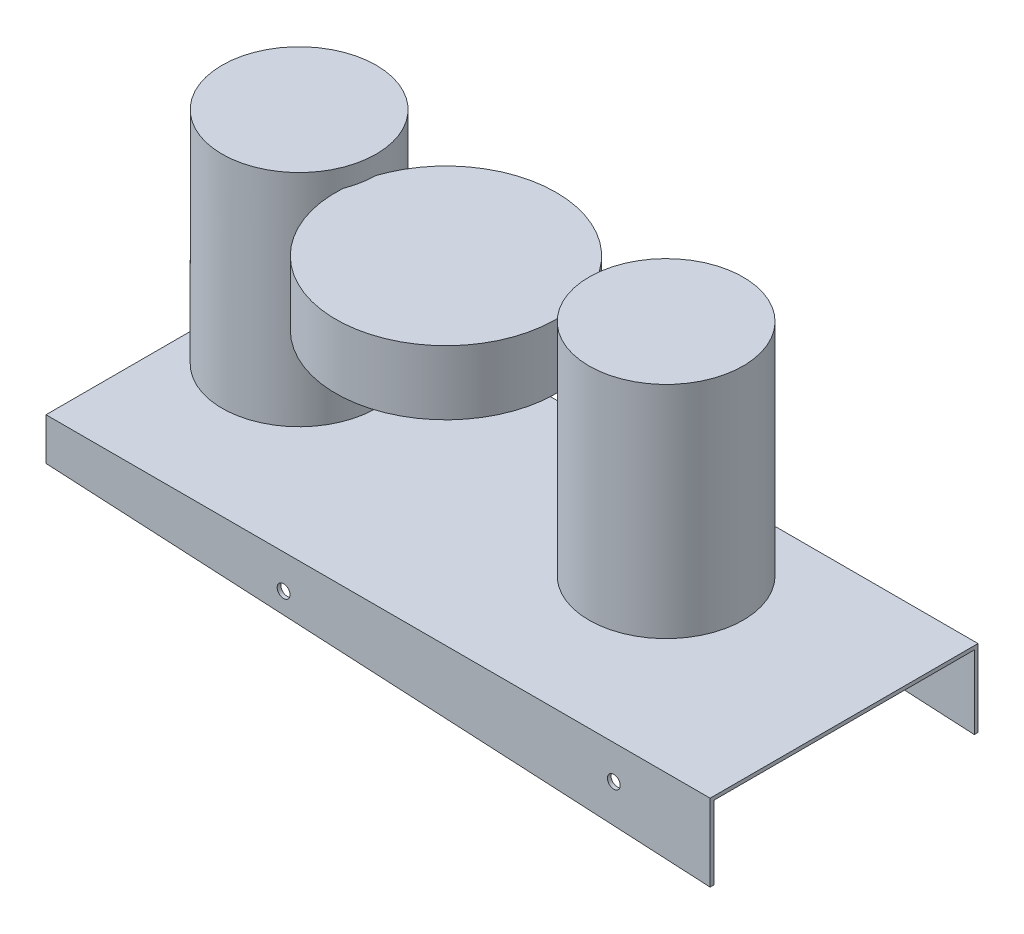
ISO-10303-21;
HEADER;
FILE_DESCRIPTION(('STEP AP214'),'2;1');
FILE_NAME('part.step','',(''),(''),'','','');
FILE_SCHEMA(('AUTOMOTIVE_DESIGN { 1 0 10303 214 1 1 1 1 }'));
ENDSEC;
DATA;
#1=APPLICATION_CONTEXT('core data for automotive mechanical design processes');
#2=APPLICATION_PROTOCOL_DEFINITION('international standard','automotive_design',2000,#1);
#3=PRODUCT_CONTEXT('',#1,'mechanical');
#4=PRODUCT('Part','Part','',(#3));
#5=PRODUCT_RELATED_PRODUCT_CATEGORY('part','',(#4));
#6=PRODUCT_DEFINITION_FORMATION('','',#4);
#7=PRODUCT_DEFINITION_CONTEXT('part definition',#1,'design');
#8=PRODUCT_DEFINITION('design','',#6,#7);
#9=PRODUCT_DEFINITION_SHAPE('','',#8);
#10=(LENGTH_UNIT() NAMED_UNIT(*) SI_UNIT(.MILLI.,.METRE.));
#11=(NAMED_UNIT(*) PLANE_ANGLE_UNIT() SI_UNIT($,.RADIAN.));
#12=(NAMED_UNIT(*) SI_UNIT($,.STERADIAN.) SOLID_ANGLE_UNIT());
#13=UNCERTAINTY_MEASURE_WITH_UNIT(LENGTH_MEASURE(1.E-05),#10,'distance_accuracy_value','');
#14=(GEOMETRIC_REPRESENTATION_CONTEXT(3) GLOBAL_UNCERTAINTY_ASSIGNED_CONTEXT((#13)) GLOBAL_UNIT_ASSIGNED_CONTEXT((#10,
#11,#12)) REPRESENTATION_CONTEXT('',''));
#15=CARTESIAN_POINT('',(0.,0.,0.));
#16=DIRECTION('',(0.,0.,1.));
#17=DIRECTION('',(1.,0.,0.));
#18=AXIS2_PLACEMENT_3D('',#15,#16,#17);
#19=CARTESIAN_POINT('',(-181.,-2.,73.));
#20=DIRECTION('',(0.,0.,1.));
#21=DIRECTION('',(1.,0.,0.));
#22=AXIS2_PLACEMENT_3D('',#19,#20,#21);
#23=PLANE('',#22);
#24=CARTESIAN_POINT('',(128.5,-18.5,73.));
#25=DIRECTION('',(0.,0.,1.));
#26=DIRECTION('',(1.,0.,0.));
#27=AXIS2_PLACEMENT_3D('',#24,#25,#26);
#28=CIRCLE('',#27,3.49999999999999);
#29=CARTESIAN_POINT('',(132.,-18.5,73.));
#30=VERTEX_POINT('',#29);
#31=EDGE_CURVE('E144',#30,#30,#28,.T.);
#32=ORIENTED_EDGE('',*,*,#31,.F.);
#33=EDGE_LOOP('',(#32));
#34=FACE_BOUND('',#33,.T.);
#35=CARTESIAN_POINT('',(-51.5,-18.5,73.));
#36=DIRECTION('',(0.,0.,1.));
#37=DIRECTION('',(1.,0.,0.));
#38=AXIS2_PLACEMENT_3D('',#35,#36,#37);
#39=CIRCLE('',#38,3.5);
#40=CARTESIAN_POINT('',(-48.,-18.5,73.));
#41=VERTEX_POINT('',#40);
#42=EDGE_CURVE('E148',#41,#41,#39,.T.);
#43=ORIENTED_EDGE('',*,*,#42,.F.);
#44=EDGE_LOOP('',(#43));
#45=FACE_BOUND('',#44,.T.);
#46=DIRECTION('',(0.,1.,0.));
#47=VECTOR('',#46,1.);
#48=CARTESIAN_POINT('',(-181.,-2.,73.));
#49=LINE('',#48,#47);
#50=CARTESIAN_POINT('',(-181.,-23.,73.));
#51=VERTEX_POINT('',#50);
#52=CARTESIAN_POINT('',(-181.,0.,73.));
#53=VERTEX_POINT('',#52);
#54=EDGE_CURVE('E217',#51,#53,#49,.T.);
#55=ORIENTED_EDGE('',*,*,#54,.F.);
#56=DIRECTION('',(0.998625439371292,-0.0524140423979408,0.));
#57=VECTOR('',#56,1.);
#58=CARTESIAN_POINT('',(-1.70111487386325,-32.410714965184,73.));
#59=LINE('',#58,#57);
#60=CARTESIAN_POINT('',(181.,-42.,73.));
#61=VERTEX_POINT('',#60);
#62=EDGE_CURVE('E163',#51,#61,#59,.T.);
#63=ORIENTED_EDGE('',*,*,#62,.T.);
#64=DIRECTION('',(0.,1.,0.));
#65=VECTOR('',#64,1.);
#66=CARTESIAN_POINT('',(181.,-2.,73.));
#67=LINE('',#66,#65);
#68=CARTESIAN_POINT('',(181.,0.,73.));
#69=VERTEX_POINT('',#68);
#70=EDGE_CURVE('E143',#61,#69,#67,.T.);
#71=ORIENTED_EDGE('',*,*,#70,.T.);
#72=DIRECTION('',(1.,0.,0.));
#73=VECTOR('',#72,1.);
#74=CARTESIAN_POINT('',(-181.,0.,73.));
#75=LINE('',#74,#73);
#76=EDGE_CURVE('E203',#53,#69,#75,.T.);
#77=ORIENTED_EDGE('',*,*,#76,.F.);
#78=EDGE_LOOP('',(#55,#63,#71,#77));
#79=FACE_BOUND('',#78,.T.);
#80=ADVANCED_FACE('F42',(#34,#45,#79),#23,.T.);
#81=CARTESIAN_POINT('',(-181.,-2.,73.));
#82=DIRECTION('',(-1.,0.,0.));
#83=DIRECTION('',(0.,0.,1.));
#84=AXIS2_PLACEMENT_3D('',#81,#82,#83);
#85=PLANE('',#84);
#86=DIRECTION('',(0.,1.,0.));
#87=VECTOR('',#86,1.);
#88=CARTESIAN_POINT('',(-181.,-2.,-73.));
#89=LINE('',#88,#87);
#90=CARTESIAN_POINT('',(-181.,-23.,-73.));
#91=VERTEX_POINT('',#90);
#92=CARTESIAN_POINT('',(-181.,0.,-73.));
#93=VERTEX_POINT('',#92);
#94=EDGE_CURVE('E219',#91,#93,#89,.T.);
#95=ORIENTED_EDGE('',*,*,#94,.F.);
#96=DIRECTION('',(0.,0.,1.));
#97=VECTOR('',#96,1.);
#98=CARTESIAN_POINT('',(-181.,-23.,-73.));
#99=LINE('',#98,#97);
#100=CARTESIAN_POINT('',(-181.,-23.,-71.));
#101=VERTEX_POINT('',#100);
#102=EDGE_CURVE('E169',#91,#101,#99,.T.);
#103=ORIENTED_EDGE('',*,*,#102,.T.);
#104=DIRECTION('',(0.,1.,0.));
#105=VECTOR('',#104,1.);
#106=CARTESIAN_POINT('',(-181.,-42.,-71.));
#107=LINE('',#106,#105);
#108=CARTESIAN_POINT('',(-181.,-2.00000000000002,-71.));
#109=VERTEX_POINT('',#108);
#110=EDGE_CURVE('E191',#101,#109,#107,.T.);
#111=ORIENTED_EDGE('',*,*,#110,.T.);
#112=DIRECTION('',(0.,0.,1.));
#113=VECTOR('',#112,1.);
#114=CARTESIAN_POINT('',(-181.,-2.,73.));
#115=LINE('',#114,#113);
#116=CARTESIAN_POINT('',(-181.,-2.00000000000002,71.));
#117=VERTEX_POINT('',#116);
#118=EDGE_CURVE('E202',#109,#117,#115,.T.);
#119=ORIENTED_EDGE('',*,*,#118,.T.);
#120=DIRECTION('',(0.,1.,0.));
#121=VECTOR('',#120,1.);
#122=CARTESIAN_POINT('',(-181.,-42.,71.));
#123=LINE('',#122,#121);
#124=CARTESIAN_POINT('',(-181.,-23.,71.));
#125=VERTEX_POINT('',#124);
#126=EDGE_CURVE('E178',#125,#117,#123,.T.);
#127=ORIENTED_EDGE('',*,*,#126,.F.);
#128=EDGE_CURVE('E168',#125,#51,#99,.T.);
#129=ORIENTED_EDGE('',*,*,#128,.T.);
#130=ORIENTED_EDGE('',*,*,#54,.T.);
#131=DIRECTION('',(0.,0.,1.));
#132=VECTOR('',#131,1.);
#133=CARTESIAN_POINT('',(-181.,0.,73.));
#134=LINE('',#133,#132);
#135=EDGE_CURVE('E211',#93,#53,#134,.T.);
#136=ORIENTED_EDGE('',*,*,#135,.F.);
#137=EDGE_LOOP('',(#95,#103,#111,#119,#127,#129,#130,#136));
#138=FACE_BOUND('',#137,.T.);
#139=ADVANCED_FACE('F254',(#138),#85,.T.);
#140=CARTESIAN_POINT('',(-181.,-2.,-73.));
#141=DIRECTION('',(0.,0.,-1.));
#142=DIRECTION('',(-1.,0.,0.));
#143=AXIS2_PLACEMENT_3D('',#140,#141,#142);
#144=PLANE('',#143);
#145=CARTESIAN_POINT('',(128.5,-18.5,-73.));
#146=DIRECTION('',(0.,0.,1.));
#147=DIRECTION('',(1.,0.,0.));
#148=AXIS2_PLACEMENT_3D('',#145,#146,#147);
#149=CIRCLE('',#148,3.49999999999999);
#150=CARTESIAN_POINT('',(132.,-18.5,-73.));
#151=VERTEX_POINT('',#150);
#152=EDGE_CURVE('E147',#151,#151,#149,.T.);
#153=ORIENTED_EDGE('',*,*,#152,.T.);
#154=EDGE_LOOP('',(#153));
#155=FACE_BOUND('',#154,.T.);
#156=CARTESIAN_POINT('',(-51.5,-18.5,-73.));
#157=DIRECTION('',(0.,0.,1.));
#158=DIRECTION('',(1.,0.,0.));
#159=AXIS2_PLACEMENT_3D('',#156,#157,#158);
#160=CIRCLE('',#159,3.5);
#161=CARTESIAN_POINT('',(-48.,-18.5,-73.));
#162=VERTEX_POINT('',#161);
#163=EDGE_CURVE('E139',#162,#162,#160,.T.);
#164=ORIENTED_EDGE('',*,*,#163,.T.);
#165=EDGE_LOOP('',(#164));
#166=FACE_BOUND('',#165,.T.);
#167=DIRECTION('',(0.,1.,0.));
#168=VECTOR('',#167,1.);
#169=CARTESIAN_POINT('',(181.,-2.,-73.));
#170=LINE('',#169,#168);
#171=CARTESIAN_POINT('',(181.,-42.,-73.));
#172=VERTEX_POINT('',#171);
#173=CARTESIAN_POINT('',(181.,0.,-73.));
#174=VERTEX_POINT('',#173);
#175=EDGE_CURVE('E206',#172,#174,#170,.T.);
#176=ORIENTED_EDGE('',*,*,#175,.F.);
#177=DIRECTION('',(0.998625439371292,-0.0524140423979408,0.));
#178=VECTOR('',#177,1.);
#179=CARTESIAN_POINT('',(-1.70111487386325,-32.410714965184,-73.));
#180=LINE('',#179,#178);
#181=EDGE_CURVE('E166',#91,#172,#180,.T.);
#182=ORIENTED_EDGE('',*,*,#181,.F.);
#183=ORIENTED_EDGE('',*,*,#94,.T.);
#184=DIRECTION('',(-1.,0.,0.));
#185=VECTOR('',#184,1.);
#186=CARTESIAN_POINT('',(-181.,0.,-73.));
#187=LINE('',#186,#185);
#188=EDGE_CURVE('E208',#174,#93,#187,.T.);
#189=ORIENTED_EDGE('',*,*,#188,.F.);
#190=EDGE_LOOP('',(#176,#182,#183,#189));
#191=FACE_BOUND('',#190,.T.);
#192=ADVANCED_FACE('F253',(#155,#166,#191),#144,.T.);
#193=CARTESIAN_POINT('',(-181.,-42.,-71.));
#194=DIRECTION('',(0.,0.,1.));
#195=DIRECTION('',(1.,0.,0.));
#196=AXIS2_PLACEMENT_3D('',#193,#194,#195);
#197=PLANE('',#196);
#198=CARTESIAN_POINT('',(128.5,-18.5,-71.));
#199=DIRECTION('',(0.,0.,1.));
#200=DIRECTION('',(1.,0.,0.));
#201=AXIS2_PLACEMENT_3D('',#198,#199,#200);
#202=CIRCLE('',#201,3.49999999999999);
#203=CARTESIAN_POINT('',(132.,-18.5,-71.));
#204=VERTEX_POINT('',#203);
#205=EDGE_CURVE('E160',#204,#204,#202,.T.);
#206=ORIENTED_EDGE('',*,*,#205,.F.);
#207=EDGE_LOOP('',(#206));
#208=FACE_BOUND('',#207,.T.);
#209=CARTESIAN_POINT('',(-51.5,-18.5,-71.));
#210=DIRECTION('',(0.,0.,1.));
#211=DIRECTION('',(1.,0.,0.));
#212=AXIS2_PLACEMENT_3D('',#209,#210,#211);
#213=CIRCLE('',#212,3.5);
#214=CARTESIAN_POINT('',(-48.,-18.5,-71.));
#215=VERTEX_POINT('',#214);
#216=EDGE_CURVE('E156',#215,#215,#213,.T.);
#217=ORIENTED_EDGE('',*,*,#216,.F.);
#218=EDGE_LOOP('',(#217));
#219=FACE_BOUND('',#218,.T.);
#220=ORIENTED_EDGE('',*,*,#110,.F.);
#221=DIRECTION('',(0.998625439371293,-0.0524140423979408,0.));
#222=VECTOR('',#221,1.);
#223=CARTESIAN_POINT('',(-180.005502073741,-23.0521974049694,-71.));
#224=LINE('',#223,#222);
#225=CARTESIAN_POINT('',(181.,-42.,-71.));
#226=VERTEX_POINT('',#225);
#227=EDGE_CURVE('E175',#101,#226,#224,.T.);
#228=ORIENTED_EDGE('',*,*,#227,.T.);
#229=DIRECTION('',(0.,1.,0.));
#230=VECTOR('',#229,1.);
#231=CARTESIAN_POINT('',(181.,-42.,-71.));
#232=LINE('',#231,#230);
#233=CARTESIAN_POINT('',(181.,-2.,-71.));
#234=VERTEX_POINT('',#233);
#235=EDGE_CURVE('E192',#226,#234,#232,.T.);
#236=ORIENTED_EDGE('',*,*,#235,.T.);
#237=DIRECTION('',(-1.,0.,0.));
#238=VECTOR('',#237,1.);
#239=CARTESIAN_POINT('',(0.,-2.,-71.));
#240=LINE('',#239,#238);
#241=EDGE_CURVE('E195',#234,#109,#240,.T.);
#242=ORIENTED_EDGE('',*,*,#241,.T.);
#243=EDGE_LOOP('',(#220,#228,#236,#242));
#244=FACE_BOUND('',#243,.T.);
#245=ADVANCED_FACE('F259',(#208,#219,#244),#197,.T.);
#246=CARTESIAN_POINT('',(-181.,-42.,71.));
#247=DIRECTION('',(0.,0.,-1.));
#248=DIRECTION('',(-1.,0.,0.));
#249=AXIS2_PLACEMENT_3D('',#246,#247,#248);
#250=PLANE('',#249);
#251=CARTESIAN_POINT('',(128.5,-18.5,71.));
#252=DIRECTION('',(0.,0.,-1.));
#253=DIRECTION('',(-1.,0.,0.));
#254=AXIS2_PLACEMENT_3D('',#251,#252,#253);
#255=CIRCLE('',#254,3.49999999999999);
#256=CARTESIAN_POINT('',(125.,-18.5,71.));
#257=VERTEX_POINT('',#256);
#258=EDGE_CURVE('E159',#257,#257,#255,.T.);
#259=ORIENTED_EDGE('',*,*,#258,.F.);
#260=EDGE_LOOP('',(#259));
#261=FACE_BOUND('',#260,.T.);
#262=CARTESIAN_POINT('',(-51.5,-18.5,71.));
#263=DIRECTION('',(0.,0.,-1.));
#264=DIRECTION('',(-1.,0.,0.));
#265=AXIS2_PLACEMENT_3D('',#262,#263,#264);
#266=CIRCLE('',#265,3.5);
#267=CARTESIAN_POINT('',(-55.,-18.5,71.));
#268=VERTEX_POINT('',#267);
#269=EDGE_CURVE('E151',#268,#268,#266,.T.);
#270=ORIENTED_EDGE('',*,*,#269,.F.);
#271=EDGE_LOOP('',(#270));
#272=FACE_BOUND('',#271,.T.);
#273=DIRECTION('',(0.,1.,0.));
#274=VECTOR('',#273,1.);
#275=CARTESIAN_POINT('',(181.,-42.,71.));
#276=LINE('',#275,#274);
#277=CARTESIAN_POINT('',(181.,-42.,71.));
#278=VERTEX_POINT('',#277);
#279=CARTESIAN_POINT('',(181.,-2.00000000000002,71.));
#280=VERTEX_POINT('',#279);
#281=EDGE_CURVE('E179',#278,#280,#276,.T.);
#282=ORIENTED_EDGE('',*,*,#281,.F.);
#283=DIRECTION('',(-0.998625439371293,0.0524140423979408,0.));
#284=VECTOR('',#283,1.);
#285=CARTESIAN_POINT('',(-180.005502073741,-23.0521974049694,71.));
#286=LINE('',#285,#284);
#287=EDGE_CURVE('E172',#278,#125,#286,.T.);
#288=ORIENTED_EDGE('',*,*,#287,.T.);
#289=ORIENTED_EDGE('',*,*,#126,.T.);
#290=DIRECTION('',(1.,0.,0.));
#291=VECTOR('',#290,1.);
#292=CARTESIAN_POINT('',(0.,-2.,71.));
#293=LINE('',#292,#291);
#294=EDGE_CURVE('E186',#117,#280,#293,.T.);
#295=ORIENTED_EDGE('',*,*,#294,.T.);
#296=EDGE_LOOP('',(#282,#288,#289,#295));
#297=FACE_BOUND('',#296,.T.);
#298=ADVANCED_FACE('F268',(#261,#272,#297),#250,.T.);
#299=CARTESIAN_POINT('',(181.,-2.,73.));
#300=DIRECTION('',(1.,0.,0.));
#301=DIRECTION('',(0.,0.,-1.));
#302=AXIS2_PLACEMENT_3D('',#299,#300,#301);
#303=PLANE('',#302);
#304=ORIENTED_EDGE('',*,*,#175,.T.);
#305=DIRECTION('',(0.,0.,-1.));
#306=VECTOR('',#305,1.);
#307=CARTESIAN_POINT('',(181.,0.,73.));
#308=LINE('',#307,#306);
#309=EDGE_CURVE('E199',#69,#174,#308,.T.);
#310=ORIENTED_EDGE('',*,*,#309,.F.);
#311=ORIENTED_EDGE('',*,*,#70,.F.);
#312=DIRECTION('',(0.,0.,-1.));
#313=VECTOR('',#312,1.);
#314=CARTESIAN_POINT('',(181.,-42.,73.));
#315=LINE('',#314,#313);
#316=EDGE_CURVE('E182',#61,#278,#315,.T.);
#317=ORIENTED_EDGE('',*,*,#316,.T.);
#318=ORIENTED_EDGE('',*,*,#281,.T.);
#319=DIRECTION('',(0.,0.,-1.));
#320=VECTOR('',#319,1.);
#321=CARTESIAN_POINT('',(181.,-2.,73.));
#322=LINE('',#321,#320);
#323=EDGE_CURVE('E200',#280,#234,#322,.T.);
#324=ORIENTED_EDGE('',*,*,#323,.T.);
#325=ORIENTED_EDGE('',*,*,#235,.F.);
#326=DIRECTION('',(0.,0.,-1.));
#327=VECTOR('',#326,1.);
#328=CARTESIAN_POINT('',(181.,-42.,-73.));
#329=LINE('',#328,#327);
#330=EDGE_CURVE('E188',#226,#172,#329,.T.);
#331=ORIENTED_EDGE('',*,*,#330,.T.);
#332=EDGE_LOOP('',(#304,#310,#311,#317,#318,#324,#325,#331));
#333=FACE_BOUND('',#332,.T.);
#334=ADVANCED_FACE('F44',(#333),#303,.T.);
#335=CARTESIAN_POINT('',(0.,-2.,0.));
#336=DIRECTION('',(0.,-1.,0.));
#337=DIRECTION('',(0.,0.,-1.));
#338=AXIS2_PLACEMENT_3D('',#335,#336,#337);
#339=PLANE('',#338);
#340=ORIENTED_EDGE('',*,*,#294,.F.);
#341=ORIENTED_EDGE('',*,*,#118,.F.);
#342=ORIENTED_EDGE('',*,*,#241,.F.);
#343=ORIENTED_EDGE('',*,*,#323,.F.);
#344=EDGE_LOOP('',(#340,#341,#342,#343));
#345=FACE_BOUND('',#344,.T.);
#346=ADVANCED_FACE('F235',(#345),#339,.T.);
#347=CARTESIAN_POINT('',(0.,0.,0.));
#348=DIRECTION('',(0.,-1.,0.));
#349=DIRECTION('',(0.,0.,-1.));
#350=AXIS2_PLACEMENT_3D('',#347,#348,#349);
#351=PLANE('',#350);
#352=CARTESIAN_POINT('',(-136.025,0.,-20.));
#353=DIRECTION('',(0.,-1.,0.));
#354=DIRECTION('',(0.,0.,-1.));
#355=AXIS2_PLACEMENT_3D('',#352,#353,#354);
#356=CIRCLE('',#355,42.);
#357=CARTESIAN_POINT('',(-136.025,0.,-62.));
#358=VERTEX_POINT('',#357);
#359=EDGE_CURVE('E125',#358,#358,#356,.F.);
#360=ORIENTED_EDGE('',*,*,#359,.F.);
#361=EDGE_LOOP('',(#360));
#362=FACE_BOUND('',#361,.T.);
#363=CARTESIAN_POINT('',(64.,0.,-20.));
#364=DIRECTION('',(0.,1.,0.));
#365=DIRECTION('',(0.,0.,1.));
#366=AXIS2_PLACEMENT_3D('',#363,#364,#365);
#367=CIRCLE('',#366,42.);
#368=CARTESIAN_POINT('',(64.,0.,22.));
#369=VERTEX_POINT('',#368);
#370=EDGE_CURVE('E140',#369,#369,#367,.T.);
#371=ORIENTED_EDGE('',*,*,#370,.F.);
#372=EDGE_LOOP('',(#371));
#373=FACE_BOUND('',#372,.T.);
#374=ORIENTED_EDGE('',*,*,#135,.T.);
#375=ORIENTED_EDGE('',*,*,#76,.T.);
#376=ORIENTED_EDGE('',*,*,#309,.T.);
#377=ORIENTED_EDGE('',*,*,#188,.T.);
#378=EDGE_LOOP('',(#374,#375,#376,#377));
#379=FACE_BOUND('',#378,.T.);
#380=ADVANCED_FACE('F231',(#362,#373,#379),#351,.F.);
#381=CARTESIAN_POINT('',(-1.70111487386325,-32.410714965184,-73.));
#382=DIRECTION('',(-0.0524140423979408,-0.998625439371292,0.));
#383=DIRECTION('',(0.998625439371292,-0.0524140423979408,0.));
#384=AXIS2_PLACEMENT_3D('',#381,#382,#383);
#385=PLANE('',#384);
#386=ORIENTED_EDGE('',*,*,#316,.F.);
#387=ORIENTED_EDGE('',*,*,#62,.F.);
#388=ORIENTED_EDGE('',*,*,#128,.F.);
#389=ORIENTED_EDGE('',*,*,#287,.F.);
#390=EDGE_LOOP('',(#386,#387,#388,#389));
#391=FACE_BOUND('',#390,.T.);
#392=ADVANCED_FACE('F234',(#391),#385,.T.);
#393=ORIENTED_EDGE('',*,*,#102,.F.);
#394=ORIENTED_EDGE('',*,*,#181,.T.);
#395=ORIENTED_EDGE('',*,*,#330,.F.);
#396=ORIENTED_EDGE('',*,*,#227,.F.);
#397=EDGE_LOOP('',(#393,#394,#395,#396));
#398=FACE_BOUND('',#397,.T.);
#399=ADVANCED_FACE('F271',(#398),#385,.T.);
#400=CARTESIAN_POINT('',(-51.5,-18.5,-73.));
#401=DIRECTION('',(0.,0.,1.));
#402=DIRECTION('',(1.,0.,0.));
#403=AXIS2_PLACEMENT_3D('',#400,#401,#402);
#404=CYLINDRICAL_SURFACE('',#403,3.5);
#405=ORIENTED_EDGE('',*,*,#269,.T.);
#406=EDGE_LOOP('',(#405));
#407=FACE_BOUND('',#406,.T.);
#408=ORIENTED_EDGE('',*,*,#42,.T.);
#409=EDGE_LOOP('',(#408));
#410=FACE_BOUND('',#409,.T.);
#411=ADVANCED_FACE('F276',(#407,#410),#404,.F.);
#412=CARTESIAN_POINT('',(128.5,-18.5,-73.));
#413=DIRECTION('',(0.,0.,1.));
#414=DIRECTION('',(1.,0.,0.));
#415=AXIS2_PLACEMENT_3D('',#412,#413,#414);
#416=CYLINDRICAL_SURFACE('',#415,3.49999999999999);
#417=ORIENTED_EDGE('',*,*,#258,.T.);
#418=EDGE_LOOP('',(#417));
#419=FACE_BOUND('',#418,.T.);
#420=ORIENTED_EDGE('',*,*,#31,.T.);
#421=EDGE_LOOP('',(#420));
#422=FACE_BOUND('',#421,.T.);
#423=ADVANCED_FACE('F303',(#419,#422),#416,.F.);
#424=ORIENTED_EDGE('',*,*,#216,.T.);
#425=EDGE_LOOP('',(#424));
#426=FACE_BOUND('',#425,.T.);
#427=ORIENTED_EDGE('',*,*,#163,.F.);
#428=EDGE_LOOP('',(#427));
#429=FACE_BOUND('',#428,.T.);
#430=ADVANCED_FACE('F300',(#426,#429),#404,.F.);
#431=ORIENTED_EDGE('',*,*,#205,.T.);
#432=EDGE_LOOP('',(#431));
#433=FACE_BOUND('',#432,.T.);
#434=ORIENTED_EDGE('',*,*,#152,.F.);
#435=EDGE_LOOP('',(#434));
#436=FACE_BOUND('',#435,.T.);
#437=ADVANCED_FACE('F302',(#433,#436),#416,.F.);
#438=CARTESIAN_POINT('',(64.,120.,-20.));
#439=DIRECTION('',(0.,-1.,0.));
#440=DIRECTION('',(0.,0.,-1.));
#441=AXIS2_PLACEMENT_3D('',#438,#439,#440);
#442=CYLINDRICAL_SURFACE('',#441,42.);
#443=CARTESIAN_POINT('',(64.,120.,-20.));
#444=DIRECTION('',(0.,1.,0.));
#445=DIRECTION('',(0.,0.,1.));
#446=AXIS2_PLACEMENT_3D('',#443,#444,#445);
#447=CIRCLE('',#446,42.);
#448=CARTESIAN_POINT('',(64.,120.,22.));
#449=VERTEX_POINT('',#448);
#450=EDGE_CURVE('E136',#449,#449,#447,.T.);
#451=ORIENTED_EDGE('',*,*,#450,.F.);
#452=EDGE_LOOP('',(#451));
#453=FACE_BOUND('',#452,.T.);
#454=ORIENTED_EDGE('',*,*,#370,.T.);
#455=EDGE_LOOP('',(#454));
#456=FACE_BOUND('',#455,.T.);
#457=ADVANCED_FACE('F309',(#453,#456),#442,.T.);
#458=CARTESIAN_POINT('',(64.,120.,-20.));
#459=DIRECTION('',(0.,1.,0.));
#460=DIRECTION('',(0.,0.,1.));
#461=AXIS2_PLACEMENT_3D('',#458,#459,#460);
#462=PLANE('',#461);
#463=ORIENTED_EDGE('',*,*,#450,.T.);
#464=EDGE_LOOP('',(#463));
#465=FACE_BOUND('',#464,.T.);
#466=ADVANCED_FACE('F351',(#465),#462,.T.);
#467=CARTESIAN_POINT('',(-136.025,120.,-20.));
#468=DIRECTION('',(0.,-1.,0.));
#469=DIRECTION('',(0.,0.,-1.));
#470=AXIS2_PLACEMENT_3D('',#467,#468,#469);
#471=CYLINDRICAL_SURFACE('',#470,42.);
#472=DIRECTION('',(0.,-1.,0.));
#473=VECTOR('',#472,1.);
#474=CARTESIAN_POINT('',(-96.88101972743,110.,-4.77670178901251));
#475=LINE('',#474,#473);
#476=CARTESIAN_POINT('',(-96.88101972743,110.,-4.77670178901251));
#477=VERTEX_POINT('',#476);
#478=CARTESIAN_POINT('',(-96.8810197274301,75.,-4.7767017890124));
#479=VERTEX_POINT('',#478);
#480=EDGE_CURVE('E50',#477,#479,#475,.T.);
#481=ORIENTED_EDGE('',*,*,#480,.F.);
#482=CARTESIAN_POINT('',(-136.025,110.,-20.));
#483=DIRECTION('',(0.,1.,0.));
#484=DIRECTION('',(0.,0.,1.));
#485=AXIS2_PLACEMENT_3D('',#482,#483,#484);
#486=CIRCLE('',#485,42.);
#487=CARTESIAN_POINT('',(-94.0264217937217,110.,-19.6544154935109));
#488=VERTEX_POINT('',#487);
#489=EDGE_CURVE('E11',#477,#488,#486,.T.);
#490=ORIENTED_EDGE('',*,*,#489,.T.);
#491=DIRECTION('',(0.,-1.,0.));
#492=VECTOR('',#491,1.);
#493=CARTESIAN_POINT('',(-94.0264217937217,110.,-19.6544154935109));
#494=LINE('',#493,#492);
#495=CARTESIAN_POINT('',(-94.0264217937217,75.,-19.654415493511));
#496=VERTEX_POINT('',#495);
#497=EDGE_CURVE('E111',#496,#488,#494,.F.);
#498=ORIENTED_EDGE('',*,*,#497,.F.);
#499=CARTESIAN_POINT('',(-136.025,75.,-20.));
#500=DIRECTION('',(0.,1.,0.));
#501=DIRECTION('',(0.,0.,1.));
#502=AXIS2_PLACEMENT_3D('',#499,#500,#501);
#503=CIRCLE('',#502,42.);
#504=EDGE_CURVE('E115',#479,#496,#503,.T.);
#505=ORIENTED_EDGE('',*,*,#504,.F.);
#506=EDGE_LOOP('',(#481,#490,#498,#505));
#507=FACE_BOUND('',#506,.T.);
#508=CARTESIAN_POINT('',(-136.025,120.,-20.));
#509=DIRECTION('',(0.,1.,0.));
#510=DIRECTION('',(0.,0.,1.));
#511=AXIS2_PLACEMENT_3D('',#508,#509,#510);
#512=CIRCLE('',#511,42.);
#513=CARTESIAN_POINT('',(-136.025,120.,22.));
#514=VERTEX_POINT('',#513);
#515=EDGE_CURVE('E130',#514,#514,#512,.T.);
#516=ORIENTED_EDGE('',*,*,#515,.F.);
#517=EDGE_LOOP('',(#516));
#518=FACE_BOUND('',#517,.T.);
#519=ORIENTED_EDGE('',*,*,#359,.T.);
#520=EDGE_LOOP('',(#519));
#521=FACE_BOUND('',#520,.T.);
#522=ADVANCED_FACE('F113',(#507,#518,#521),#471,.T.);
#523=CARTESIAN_POINT('',(-136.025,120.,-20.));
#524=DIRECTION('',(0.,1.,0.));
#525=DIRECTION('',(0.,0.,1.));
#526=AXIS2_PLACEMENT_3D('',#523,#524,#525);
#527=PLANE('',#526);
#528=ORIENTED_EDGE('',*,*,#515,.T.);
#529=EDGE_LOOP('',(#528));
#530=FACE_BOUND('',#529,.T.);
#531=ADVANCED_FACE('F370',(#530),#527,.T.);
#532=CARTESIAN_POINT('',(-37.,110.,-1.00000000000001));
#533=DIRECTION('',(0.,1.,0.));
#534=DIRECTION('',(-1.,0.,0.));
#535=AXIS2_PLACEMENT_3D('',#532,#533,#534);
#536=ELLIPSE('',#535,60.,60.);
#537=DIRECTION('',(0.,-1.,0.));
#538=VECTOR('',#537,1.);
#539=SURFACE_OF_LINEAR_EXTRUSION('',#536,#538);
#540=EDGE_CURVE('E128',#477,#488,#536,.T.);
#541=ORIENTED_EDGE('',*,*,#540,.F.);
#542=ORIENTED_EDGE('',*,*,#480,.T.);
#543=CARTESIAN_POINT('',(-37.,75.,-1.00000000000001));
#544=DIRECTION('',(0.,1.,0.));
#545=DIRECTION('',(-1.,0.,0.));
#546=AXIS2_PLACEMENT_3D('',#543,#544,#545);
#547=ELLIPSE('',#546,60.,60.);
#548=EDGE_CURVE('E124',#479,#496,#547,.T.);
#549=ORIENTED_EDGE('',*,*,#548,.T.);
#550=ORIENTED_EDGE('',*,*,#497,.T.);
#551=EDGE_LOOP('',(#541,#542,#549,#550));
#552=FACE_BOUND('',#551,.T.);
#553=ADVANCED_FACE('F127',(#552),#539,.F.);
#554=CARTESIAN_POINT('',(0.,110.,0.));
#555=DIRECTION('',(0.,1.,0.));
#556=DIRECTION('',(0.,0.,1.));
#557=AXIS2_PLACEMENT_3D('',#554,#555,#556);
#558=PLANE('',#557);
#559=ORIENTED_EDGE('',*,*,#489,.F.);
#560=ORIENTED_EDGE('',*,*,#540,.T.);
#561=EDGE_LOOP('',(#559,#560));
#562=FACE_BOUND('',#561,.T.);
#563=ADVANCED_FACE('F392',(#562),#558,.T.);
#564=CARTESIAN_POINT('',(0.,75.,0.));
#565=DIRECTION('',(0.,1.,0.));
#566=DIRECTION('',(0.,0.,1.));
#567=AXIS2_PLACEMENT_3D('',#564,#565,#566);
#568=PLANE('',#567);
#569=ORIENTED_EDGE('',*,*,#548,.F.);
#570=ORIENTED_EDGE('',*,*,#504,.T.);
#571=EDGE_LOOP('',(#569,#570));
#572=FACE_BOUND('',#571,.T.);
#573=ADVANCED_FACE('F123',(#572),#568,.F.);
#574=CLOSED_SHELL('',(#80,#139,#192,#245,#298,#334,#346,#380,#392,#399,#411,#423,#430,#437,#457,
#466,#522,#531,#553,#563,#573));
#575=MANIFOLD_SOLID_BREP('B2',#574);
#576=ADVANCED_BREP_SHAPE_REPRESENTATION('',(#18,#575),#14);
#577=SHAPE_DEFINITION_REPRESENTATION(#9,#576);
ENDSEC;
END-ISO-10303-21;
